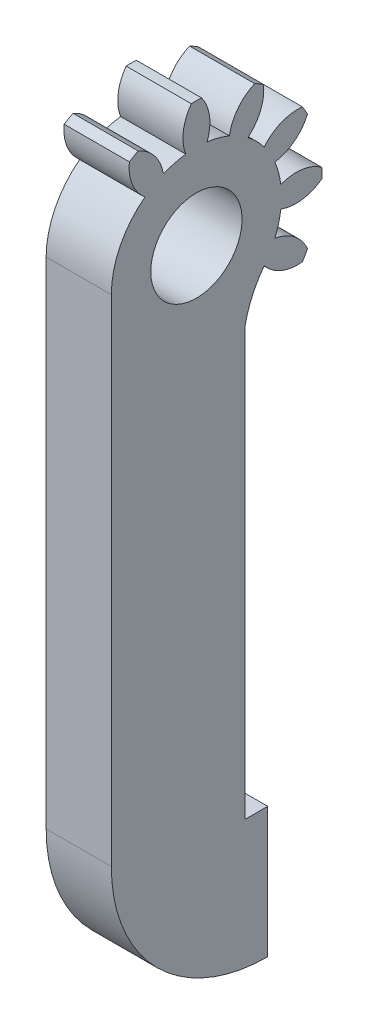
ISO-10303-21;
HEADER;
FILE_DESCRIPTION(('STEP AP214'),'2;1');
FILE_NAME('part.step','',(''),(''),'','','');
FILE_SCHEMA(('AUTOMOTIVE_DESIGN { 1 0 10303 214 1 1 1 1 }'));
ENDSEC;
DATA;
#1=APPLICATION_CONTEXT('core data for automotive mechanical design processes');
#2=APPLICATION_PROTOCOL_DEFINITION('international standard','automotive_design',2000,#1);
#3=PRODUCT_CONTEXT('',#1,'mechanical');
#4=PRODUCT('Part','Part','',(#3));
#5=PRODUCT_RELATED_PRODUCT_CATEGORY('part','',(#4));
#6=PRODUCT_DEFINITION_FORMATION('','',#4);
#7=PRODUCT_DEFINITION_CONTEXT('part definition',#1,'design');
#8=PRODUCT_DEFINITION('design','',#6,#7);
#9=PRODUCT_DEFINITION_SHAPE('','',#8);
#10=(LENGTH_UNIT() NAMED_UNIT(*) SI_UNIT(.MILLI.,.METRE.));
#11=(NAMED_UNIT(*) PLANE_ANGLE_UNIT() SI_UNIT($,.RADIAN.));
#12=(NAMED_UNIT(*) SI_UNIT($,.STERADIAN.) SOLID_ANGLE_UNIT());
#13=UNCERTAINTY_MEASURE_WITH_UNIT(LENGTH_MEASURE(1.E-05),#10,'distance_accuracy_value','');
#14=(GEOMETRIC_REPRESENTATION_CONTEXT(3) GLOBAL_UNCERTAINTY_ASSIGNED_CONTEXT((#13)) GLOBAL_UNIT_ASSIGNED_CONTEXT((#10,
#11,#12)) REPRESENTATION_CONTEXT('',''));
#15=CARTESIAN_POINT('',(0.,0.,0.));
#16=DIRECTION('',(0.,0.,1.));
#17=DIRECTION('',(1.,0.,0.));
#18=AXIS2_PLACEMENT_3D('',#15,#16,#17);
#19=CARTESIAN_POINT('',(5.,0.,0.));
#20=DIRECTION('',(-1.,0.,0.));
#21=DIRECTION('',(0.,-0.258819045102521,0.965925826289068));
#22=AXIS2_PLACEMENT_3D('',#19,#20,#21);
#23=CYLINDRICAL_SURFACE('',#22,6.53025);
#24=CARTESIAN_POINT('',(0.,0.,0.));
#25=DIRECTION('',(-1.,0.,0.));
#26=DIRECTION('',(0.,0.707106781186549,-0.707106781186546));
#27=AXIS2_PLACEMENT_3D('',#24,#25,#26);
#28=CIRCLE('',#27,6.53025);
#29=CARTESIAN_POINT('',(0.,0.,6.53025));
#30=VERTEX_POINT('',#29);
#31=CARTESIAN_POINT('',(0.,5.20307403430747,3.94616087558724));
#32=VERTEX_POINT('',#31);
#33=EDGE_CURVE('E375',#30,#32,#28,.T.);
#34=ORIENTED_EDGE('',*,*,#33,.F.);
#35=DIRECTION('',(1.,0.,0.));
#36=VECTOR('',#35,1.);
#37=CARTESIAN_POINT('',(-51.4198405287297,0.,6.53025));
#38=LINE('',#37,#36);
#39=CARTESIAN_POINT('',(5.,0.,6.53025));
#40=VERTEX_POINT('',#39);
#41=EDGE_CURVE('E682',#30,#40,#38,.T.);
#42=ORIENTED_EDGE('',*,*,#41,.T.);
#43=CARTESIAN_POINT('',(5.,0.,0.));
#44=DIRECTION('',(-1.,0.,0.));
#45=DIRECTION('',(0.,0.707106781186549,-0.707106781186546));
#46=AXIS2_PLACEMENT_3D('',#43,#44,#45);
#47=CIRCLE('',#46,6.53025);
#48=CARTESIAN_POINT('',(5.,5.20307403430747,3.94616087558724));
#49=VERTEX_POINT('',#48);
#50=EDGE_CURVE('E374',#40,#49,#47,.T.);
#51=ORIENTED_EDGE('',*,*,#50,.T.);
#52=DIRECTION('',(-1.,0.,0.));
#53=VECTOR('',#52,1.);
#54=CARTESIAN_POINT('',(5.,5.20307403430747,3.94616087558724));
#55=LINE('',#54,#53);
#56=EDGE_CURVE('E378',#49,#32,#55,.T.);
#57=ORIENTED_EDGE('',*,*,#56,.T.);
#58=EDGE_LOOP('',(#34,#42,#51,#57));
#59=FACE_BOUND('',#58,.T.);
#60=ADVANCED_FACE('F39',(#59),#23,.T.);
#61=CARTESIAN_POINT('',(5.,0.,0.));
#62=DIRECTION('',(-1.,0.,0.));
#63=DIRECTION('',(0.,-0.258819045102521,0.965925826289068));
#64=AXIS2_PLACEMENT_3D('',#61,#62,#63);
#65=PLANE('',#64);
#66=CARTESIAN_POINT('',(5.,0.,0.));
#67=DIRECTION('',(-1.,0.,0.));
#68=DIRECTION('',(0.,-0.258819045102521,0.965925826289068));
#69=AXIS2_PLACEMENT_3D('',#66,#67,#68);
#70=CIRCLE('',#69,3.5);
#71=CARTESIAN_POINT('',(5.,-0.905866657858825,3.38074039201174));
#72=VERTEX_POINT('',#71);
#73=EDGE_CURVE('E312',#72,#72,#70,.F.);
#74=ORIENTED_EDGE('',*,*,#73,.F.);
#75=EDGE_LOOP('',(#74));
#76=FACE_BOUND('',#75,.T.);
#77=ORIENTED_EDGE('',*,*,#50,.F.);
#78=DIRECTION('',(0.,-1.,0.));
#79=VECTOR('',#78,1.);
#80=CARTESIAN_POINT('',(5.,0.,6.53025));
#81=LINE('',#80,#79);
#82=CARTESIAN_POINT('',(5.,-38.,6.53025));
#83=VERTEX_POINT('',#82);
#84=EDGE_CURVE('E262',#40,#83,#81,.T.);
#85=ORIENTED_EDGE('',*,*,#84,.T.);
#86=CARTESIAN_POINT('',(5.,-38.,-5.46975));
#87=DIRECTION('',(1.,0.,0.));
#88=DIRECTION('',(0.,0.,-1.));
#89=AXIS2_PLACEMENT_3D('',#86,#87,#88);
#90=CIRCLE('',#89,12.);
#91=CARTESIAN_POINT('',(5.,-50.,-5.46975));
#92=VERTEX_POINT('',#91);
#93=EDGE_CURVE('E723',#83,#92,#90,.T.);
#94=ORIENTED_EDGE('',*,*,#93,.T.);
#95=DIRECTION('',(0.,1.,0.));
#96=VECTOR('',#95,1.);
#97=CARTESIAN_POINT('',(5.,-50.,-5.46975));
#98=LINE('',#97,#96);
#99=CARTESIAN_POINT('',(5.,-40.,-5.46975));
#100=VERTEX_POINT('',#99);
#101=EDGE_CURVE('E727',#92,#100,#98,.T.);
#102=ORIENTED_EDGE('',*,*,#101,.T.);
#103=DIRECTION('',(0.,0.,1.));
#104=VECTOR('',#103,1.);
#105=CARTESIAN_POINT('',(5.,-40.,-5.46975));
#106=LINE('',#105,#104);
#107=CARTESIAN_POINT('',(5.,-40.,-3.71975));
#108=VERTEX_POINT('',#107);
#109=EDGE_CURVE('E730',#100,#108,#106,.T.);
#110=ORIENTED_EDGE('',*,*,#109,.T.);
#111=DIRECTION('',(0.,1.,0.));
#112=VECTOR('',#111,1.);
#113=CARTESIAN_POINT('',(5.,-40.,-3.71975));
#114=LINE('',#113,#112);
#115=CARTESIAN_POINT('',(5.,-7.27695193070973,-3.71975));
#116=VERTEX_POINT('',#115);
#117=EDGE_CURVE('E260',#108,#116,#114,.T.);
#118=ORIENTED_EDGE('',*,*,#117,.T.);
#119=CARTESIAN_POINT('',(5.,-8.78047610160418,-11.5771932907617));
#120=DIRECTION('',(-1.,0.,0.));
#121=DIRECTION('',(0.,0.,-1.));
#122=AXIS2_PLACEMENT_3D('',#119,#120,#121);
#123=CIRCLE('',#122,8.);
#124=CARTESIAN_POINT('',(5.,-3.94616087558718,-5.20307403430751));
#125=VERTEX_POINT('',#124);
#126=EDGE_CURVE('E243',#116,#125,#123,.T.);
#127=ORIENTED_EDGE('',*,*,#126,.T.);
#128=CARTESIAN_POINT('',(5.,-1.86722961459183,-7.76589373379014));
#129=DIRECTION('',(-1.,0.,0.));
#130=DIRECTION('',(0.,-0.707106781186554,0.707106781186541));
#131=AXIS2_PLACEMENT_3D('',#128,#129,#130);
#132=CIRCLE('',#131,3.3);
#133=CARTESIAN_POINT('',(5.,-5.14670283362097,-8.13339258504088));
#134=VERTEX_POINT('',#133);
#135=EDGE_CURVE('E251',#134,#125,#132,.T.);
#136=ORIENTED_EDGE('',*,*,#135,.F.);
#137=CARTESIAN_POINT('',(5.,0.,0.));
#138=DIRECTION('',(-1.,0.,0.));
#139=DIRECTION('',(0.,-0.258819045102521,0.965925826289068));
#140=AXIS2_PLACEMENT_3D('',#137,#138,#139);
#141=CIRCLE('',#140,9.625);
#142=CARTESIAN_POINT('',(5.,-4.47037318078674,-8.52387169216564));
#143=VERTEX_POINT('',#142);
#144=EDGE_CURVE('E435',#143,#134,#141,.T.);
#145=ORIENTED_EDGE('',*,*,#144,.F.);
#146=CARTESIAN_POINT('',(5.,-5.79184644925663,-5.50001514783033));
#147=DIRECTION('',(-1.,0.,0.));
#148=DIRECTION('',(0.,-0.965925826289071,0.258819045102511));
#149=AXIS2_PLACEMENT_3D('',#146,#147,#148);
#150=CIRCLE('',#149,3.3);
#151=CARTESIAN_POINT('',(5.,-2.53291385368778,-6.01901258283255));
#152=VERTEX_POINT('',#151);
#153=EDGE_CURVE('E689',#152,#143,#150,.T.);
#154=ORIENTED_EDGE('',*,*,#153,.F.);
#155=CARTESIAN_POINT('',(5.,0.,0.));
#156=DIRECTION('',(-1.,0.,0.));
#157=DIRECTION('',(0.,-0.965925826289071,0.258819045102511));
#158=AXIS2_PLACEMENT_3D('',#155,#156,#157);
#159=CIRCLE('',#158,6.53025);
#160=CARTESIAN_POINT('',(5.,-0.815938548524985,-6.47907472927508));
#161=VERTEX_POINT('',#160);
#162=EDGE_CURVE('E695',#161,#152,#159,.T.);
#163=ORIENTED_EDGE('',*,*,#162,.F.);
#164=CARTESIAN_POINT('',(5.,2.26587858595993,-7.65907606384856));
#165=DIRECTION('',(-1.,0.,0.));
#166=DIRECTION('',(0.,-0.965925826289071,0.258819045102511));
#167=AXIS2_PLACEMENT_3D('',#164,#165,#166);
#168=CIRCLE('',#167,3.3);
#169=CARTESIAN_POINT('',(5.,-0.390479107124668,-9.61707601440787));
#170=VERTEX_POINT('',#169);
#171=EDGE_CURVE('E501',#170,#161,#168,.T.);
#172=ORIENTED_EDGE('',*,*,#171,.F.);
#173=CARTESIAN_POINT('',(5.,0.39047910712487,-9.61707601440786));
#174=VERTEX_POINT('',#173);
#175=EDGE_CURVE('E498',#174,#170,#141,.T.);
#176=ORIENTED_EDGE('',*,*,#175,.F.);
#177=CARTESIAN_POINT('',(5.,-2.26587858595977,-7.65907606384861));
#178=DIRECTION('',(-1.,0.,0.));
#179=DIRECTION('',(0.,-0.965925826289065,-0.258819045102531));
#180=AXIS2_PLACEMENT_3D('',#177,#178,#179);
#181=CIRCLE('',#180,3.3);
#182=CARTESIAN_POINT('',(5.,0.815938548525121,-6.47907472927507));
#183=VERTEX_POINT('',#182);
#184=EDGE_CURVE('E275',#183,#174,#181,.T.);
#185=ORIENTED_EDGE('',*,*,#184,.F.);
#186=CARTESIAN_POINT('',(5.,0.,0.));
#187=DIRECTION('',(-1.,0.,0.));
#188=DIRECTION('',(0.,-0.965925826289065,-0.258819045102531));
#189=AXIS2_PLACEMENT_3D('',#186,#187,#188);
#190=CIRCLE('',#189,6.53025);
#191=CARTESIAN_POINT('',(5.,2.53291385368791,-6.0190125828325));
#192=VERTEX_POINT('',#191);
#193=EDGE_CURVE('E282',#192,#183,#190,.T.);
#194=ORIENTED_EDGE('',*,*,#193,.F.);
#195=CARTESIAN_POINT('',(5.,5.79184644925675,-5.5000151478302));
#196=DIRECTION('',(-1.,0.,0.));
#197=DIRECTION('',(0.,-0.965925826289065,-0.258819045102531));
#198=AXIS2_PLACEMENT_3D('',#195,#196,#197);
#199=CIRCLE('',#198,3.3);
#200=CARTESIAN_POINT('',(5.,4.47037318078692,-8.52387169216555));
#201=VERTEX_POINT('',#200);
#202=EDGE_CURVE('E278',#201,#192,#199,.T.);
#203=ORIENTED_EDGE('',*,*,#202,.F.);
#204=CARTESIAN_POINT('',(5.,5.14670283362114,-8.13339258504077));
#205=VERTEX_POINT('',#204);
#206=EDGE_CURVE('E479',#205,#201,#141,.T.);
#207=ORIENTED_EDGE('',*,*,#206,.F.);
#208=CARTESIAN_POINT('',(5.,1.86722961459199,-7.7658937337901));
#209=DIRECTION('',(-1.,0.,0.));
#210=DIRECTION('',(0.,-0.707106781186539,-0.707106781186556));
#211=AXIS2_PLACEMENT_3D('',#208,#209,#210);
#212=CIRCLE('',#211,3.3);
#213=CARTESIAN_POINT('',(5.,3.9461608755873,-5.20307403430743));
#214=VERTEX_POINT('',#213);
#215=EDGE_CURVE('E323',#214,#205,#212,.T.);
#216=ORIENTED_EDGE('',*,*,#215,.F.);
#217=CARTESIAN_POINT('',(5.,0.,0.));
#218=DIRECTION('',(-1.,0.,0.));
#219=DIRECTION('',(0.,-0.707106781186539,-0.707106781186556));
#220=AXIS2_PLACEMENT_3D('',#217,#218,#219);
#221=CIRCLE('',#220,6.53025);
#222=CARTESIAN_POINT('',(5.,5.20307403430752,-3.94616087558717));
#223=VERTEX_POINT('',#222);
#224=EDGE_CURVE('E330',#223,#214,#221,.T.);
#225=ORIENTED_EDGE('',*,*,#224,.F.);
#226=CARTESIAN_POINT('',(5.,7.76589373379015,-1.8672296145918));
#227=DIRECTION('',(-1.,0.,0.));
#228=DIRECTION('',(0.,-0.707106781186539,-0.707106781186556));
#229=AXIS2_PLACEMENT_3D('',#226,#227,#228);
#230=CIRCLE('',#229,3.3);
#231=CARTESIAN_POINT('',(5.,8.13339258504089,-5.14670283362094));
#232=VERTEX_POINT('',#231);
#233=EDGE_CURVE('E326',#232,#223,#230,.T.);
#234=ORIENTED_EDGE('',*,*,#233,.F.);
#235=CARTESIAN_POINT('',(5.,8.52387169216565,-4.47037318078671));
#236=VERTEX_POINT('',#235);
#237=EDGE_CURVE('E434',#236,#232,#141,.T.);
#238=ORIENTED_EDGE('',*,*,#237,.F.);
#239=CARTESIAN_POINT('',(5.,5.50001514783035,-5.79184644925661));
#240=DIRECTION('',(-1.,0.,0.));
#241=DIRECTION('',(0.,-0.258819045102508,-0.965925826289072));
#242=AXIS2_PLACEMENT_3D('',#239,#240,#241);
#243=CIRCLE('',#242,3.3);
#244=CARTESIAN_POINT('',(5.,6.01901258283256,-2.53291385368776));
#245=VERTEX_POINT('',#244);
#246=EDGE_CURVE('E297',#245,#236,#243,.T.);
#247=ORIENTED_EDGE('',*,*,#246,.F.);
#248=CARTESIAN_POINT('',(5.,0.,0.));
#249=DIRECTION('',(-1.,0.,0.));
#250=DIRECTION('',(0.,-0.258819045102508,-0.965925826289072));
#251=AXIS2_PLACEMENT_3D('',#248,#249,#250);
#252=CIRCLE('',#251,6.53025);
#253=CARTESIAN_POINT('',(5.,6.47907472927509,-0.815938548524962));
#254=VERTEX_POINT('',#253);
#255=EDGE_CURVE('E304',#254,#245,#252,.T.);
#256=ORIENTED_EDGE('',*,*,#255,.F.);
#257=CARTESIAN_POINT('',(5.,7.65907606384855,2.26587858595996));
#258=DIRECTION('',(-1.,0.,0.));
#259=DIRECTION('',(0.,-0.258819045102508,-0.965925826289072));
#260=AXIS2_PLACEMENT_3D('',#257,#258,#259);
#261=CIRCLE('',#260,3.3);
#262=CARTESIAN_POINT('',(5.,9.61707601440787,-0.390479107124634));
#263=VERTEX_POINT('',#262);
#264=EDGE_CURVE('E300',#263,#254,#261,.T.);
#265=ORIENTED_EDGE('',*,*,#264,.F.);
#266=CARTESIAN_POINT('',(5.,9.61707601440787,0.39047910712477));
#267=VERTEX_POINT('',#266);
#268=EDGE_CURVE('E429',#267,#263,#141,.T.);
#269=ORIENTED_EDGE('',*,*,#268,.F.);
#270=CARTESIAN_POINT('',(5.,7.65907606384858,-2.26587858595985));
#271=DIRECTION('',(-1.,0.,0.));
#272=DIRECTION('',(0.,0.258819045102521,-0.965925826289068));
#273=AXIS2_PLACEMENT_3D('',#270,#271,#272);
#274=CIRCLE('',#273,3.3);
#275=CARTESIAN_POINT('',(5.,6.47907472927507,0.815938548525054));
#276=VERTEX_POINT('',#275);
#277=EDGE_CURVE('E391',#276,#267,#274,.T.);
#278=ORIENTED_EDGE('',*,*,#277,.F.);
#279=CARTESIAN_POINT('',(5.,0.,0.));
#280=DIRECTION('',(-1.,0.,0.));
#281=DIRECTION('',(0.,0.258819045102521,-0.965925826289068));
#282=AXIS2_PLACEMENT_3D('',#279,#280,#281);
#283=CIRCLE('',#282,6.53025);
#284=CARTESIAN_POINT('',(5.,6.01901258283252,2.53291385368785));
#285=VERTEX_POINT('',#284);
#286=EDGE_CURVE('E398',#285,#276,#283,.T.);
#287=ORIENTED_EDGE('',*,*,#286,.F.);
#288=CARTESIAN_POINT('',(5.,5.50001514783026,5.79184644925669));
#289=DIRECTION('',(-1.,0.,0.));
#290=DIRECTION('',(0.,0.258819045102521,-0.965925826289068));
#291=AXIS2_PLACEMENT_3D('',#288,#289,#290);
#292=CIRCLE('',#291,3.3);
#293=CARTESIAN_POINT('',(5.,8.52387169216559,4.47037318078683));
#294=VERTEX_POINT('',#293);
#295=EDGE_CURVE('E394',#294,#285,#292,.T.);
#296=ORIENTED_EDGE('',*,*,#295,.F.);
#297=CARTESIAN_POINT('',(5.,8.13339258504082,5.14670283362106));
#298=VERTEX_POINT('',#297);
#299=EDGE_CURVE('E426',#298,#294,#141,.T.);
#300=ORIENTED_EDGE('',*,*,#299,.F.);
#301=CARTESIAN_POINT('',(5.,7.76589373379012,1.86722961459191));
#302=DIRECTION('',(-1.,0.,0.));
#303=DIRECTION('',(0.,0.707106781186549,-0.707106781186546));
#304=AXIS2_PLACEMENT_3D('',#301,#302,#303);
#305=CIRCLE('',#304,3.3);
#306=EDGE_CURVE('E371',#49,#298,#305,.T.);
#307=ORIENTED_EDGE('',*,*,#306,.F.);
#308=EDGE_LOOP('',(#77,#85,#94,#102,#110,#118,#127,#136,#145,#154,#163,#172,#176,#185,#194,#203,
#207,#216,#225,#234,#238,#247,#256,#265,#269,#278,#287,#296,#300,#307));
#309=FACE_BOUND('',#308,.T.);
#310=ADVANCED_FACE('F41',(#76,#309),#65,.F.);
#311=CARTESIAN_POINT('',(-10.,0.,0.));
#312=DIRECTION('',(-1.,0.,0.));
#313=DIRECTION('',(0.,-0.258819045102521,0.965925826289068));
#314=AXIS2_PLACEMENT_3D('',#311,#312,#313);
#315=CYLINDRICAL_SURFACE('',#314,9.625);
#316=DIRECTION('',(-1.,0.,0.));
#317=VECTOR('',#316,1.);
#318=CARTESIAN_POINT('',(2.5,-4.47037318078674,-8.52387169216564));
#319=LINE('',#318,#317);
#320=CARTESIAN_POINT('',(0.,-4.47037318078674,-8.52387169216564));
#321=VERTEX_POINT('',#320);
#322=EDGE_CURVE('E367',#143,#321,#319,.T.);
#323=ORIENTED_EDGE('',*,*,#322,.F.);
#324=ORIENTED_EDGE('',*,*,#144,.T.);
#325=DIRECTION('',(-1.,0.,0.));
#326=VECTOR('',#325,1.);
#327=CARTESIAN_POINT('',(2.5,-5.14670283362097,-8.13339258504088));
#328=LINE('',#327,#326);
#329=CARTESIAN_POINT('',(0.,-5.14670283362097,-8.13339258504088));
#330=VERTEX_POINT('',#329);
#331=EDGE_CURVE('E266',#330,#134,#328,.F.);
#332=ORIENTED_EDGE('',*,*,#331,.F.);
#333=CARTESIAN_POINT('',(0.,0.,0.));
#334=DIRECTION('',(-1.,0.,0.));
#335=DIRECTION('',(0.,-0.258819045102521,0.965925826289068));
#336=AXIS2_PLACEMENT_3D('',#333,#334,#335);
#337=CIRCLE('',#336,9.625);
#338=EDGE_CURVE('E428',#321,#330,#337,.T.);
#339=ORIENTED_EDGE('',*,*,#338,.F.);
#340=EDGE_LOOP('',(#323,#324,#332,#339));
#341=FACE_BOUND('',#340,.T.);
#342=ADVANCED_FACE('F454',(#341),#315,.T.);
#343=DIRECTION('',(-1.,0.,0.));
#344=VECTOR('',#343,1.);
#345=CARTESIAN_POINT('',(2.5,-0.39047910712467,-9.61707601440787));
#346=LINE('',#345,#344);
#347=CARTESIAN_POINT('',(0.,-0.390479107124669,-9.61707601440787));
#348=VERTEX_POINT('',#347);
#349=EDGE_CURVE('E364',#348,#170,#346,.F.);
#350=ORIENTED_EDGE('',*,*,#349,.F.);
#351=CARTESIAN_POINT('',(0.,0.390479107124871,-9.61707601440786));
#352=VERTEX_POINT('',#351);
#353=EDGE_CURVE('E458',#352,#348,#337,.T.);
#354=ORIENTED_EDGE('',*,*,#353,.F.);
#355=DIRECTION('',(-1.,0.,0.));
#356=VECTOR('',#355,1.);
#357=CARTESIAN_POINT('',(2.5,0.390479107124871,-9.61707601440786));
#358=LINE('',#357,#356);
#359=EDGE_CURVE('E359',#174,#352,#358,.T.);
#360=ORIENTED_EDGE('',*,*,#359,.F.);
#361=ORIENTED_EDGE('',*,*,#175,.T.);
#362=EDGE_LOOP('',(#350,#354,#360,#361));
#363=FACE_BOUND('',#362,.T.);
#364=ADVANCED_FACE('F497',(#363),#315,.T.);
#365=DIRECTION('',(-1.,0.,0.));
#366=VECTOR('',#365,1.);
#367=CARTESIAN_POINT('',(2.5,4.47037318078692,-8.52387169216555));
#368=LINE('',#367,#366);
#369=CARTESIAN_POINT('',(0.,4.47037318078692,-8.52387169216555));
#370=VERTEX_POINT('',#369);
#371=EDGE_CURVE('E356',#370,#201,#368,.F.);
#372=ORIENTED_EDGE('',*,*,#371,.F.);
#373=CARTESIAN_POINT('',(0.,5.14670283362114,-8.13339258504076));
#374=VERTEX_POINT('',#373);
#375=EDGE_CURVE('E462',#374,#370,#337,.T.);
#376=ORIENTED_EDGE('',*,*,#375,.F.);
#377=DIRECTION('',(-1.,0.,0.));
#378=VECTOR('',#377,1.);
#379=CARTESIAN_POINT('',(2.5,5.14670283362114,-8.13339258504076));
#380=LINE('',#379,#378);
#381=EDGE_CURVE('E347',#205,#374,#380,.T.);
#382=ORIENTED_EDGE('',*,*,#381,.F.);
#383=ORIENTED_EDGE('',*,*,#206,.T.);
#384=EDGE_LOOP('',(#372,#376,#382,#383));
#385=FACE_BOUND('',#384,.T.);
#386=ADVANCED_FACE('F476',(#385),#315,.T.);
#387=DIRECTION('',(-1.,0.,0.));
#388=VECTOR('',#387,1.);
#389=CARTESIAN_POINT('',(2.5,8.52387169216565,-4.47037318078671));
#390=LINE('',#389,#388);
#391=CARTESIAN_POINT('',(0.,8.52387169216565,-4.47037318078671));
#392=VERTEX_POINT('',#391);
#393=EDGE_CURVE('E353',#236,#392,#390,.T.);
#394=ORIENTED_EDGE('',*,*,#393,.F.);
#395=ORIENTED_EDGE('',*,*,#237,.T.);
#396=DIRECTION('',(-1.,0.,0.));
#397=VECTOR('',#396,1.);
#398=CARTESIAN_POINT('',(2.5,8.13339258504089,-5.14670283362094));
#399=LINE('',#398,#397);
#400=CARTESIAN_POINT('',(0.,8.13339258504089,-5.14670283362094));
#401=VERTEX_POINT('',#400);
#402=EDGE_CURVE('E250',#401,#232,#399,.F.);
#403=ORIENTED_EDGE('',*,*,#402,.F.);
#404=EDGE_CURVE('E427',#392,#401,#337,.T.);
#405=ORIENTED_EDGE('',*,*,#404,.F.);
#406=EDGE_LOOP('',(#394,#395,#403,#405));
#407=FACE_BOUND('',#406,.T.);
#408=ADVANCED_FACE('F516',(#407),#315,.T.);
#409=DIRECTION('',(-1.,0.,0.));
#410=VECTOR('',#409,1.);
#411=CARTESIAN_POINT('',(2.5,9.61707601440787,-0.390479107124634));
#412=LINE('',#411,#410);
#413=CARTESIAN_POINT('',(0.,9.61707601440787,-0.390479107124634));
#414=VERTEX_POINT('',#413);
#415=EDGE_CURVE('E350',#414,#263,#412,.F.);
#416=ORIENTED_EDGE('',*,*,#415,.F.);
#417=CARTESIAN_POINT('',(0.,9.61707601440786,0.39047910712477));
#418=VERTEX_POINT('',#417);
#419=EDGE_CURVE('E422',#418,#414,#337,.T.);
#420=ORIENTED_EDGE('',*,*,#419,.F.);
#421=DIRECTION('',(-1.,0.,0.));
#422=VECTOR('',#421,1.);
#423=CARTESIAN_POINT('',(2.5,9.61707601440786,0.39047910712477));
#424=LINE('',#423,#422);
#425=EDGE_CURVE('E418',#267,#418,#424,.T.);
#426=ORIENTED_EDGE('',*,*,#425,.F.);
#427=ORIENTED_EDGE('',*,*,#268,.T.);
#428=EDGE_LOOP('',(#416,#420,#426,#427));
#429=FACE_BOUND('',#428,.T.);
#430=ADVANCED_FACE('F564',(#429),#315,.T.);
#431=CARTESIAN_POINT('',(0.,0.,0.));
#432=DIRECTION('',(1.,0.,0.));
#433=DIRECTION('',(0.,0.258819045102521,-0.965925826289068));
#434=AXIS2_PLACEMENT_3D('',#431,#432,#433);
#435=PLANE('',#434);
#436=CARTESIAN_POINT('',(0.,0.,0.));
#437=DIRECTION('',(1.,0.,0.));
#438=DIRECTION('',(0.,0.258819045102521,-0.965925826289068));
#439=AXIS2_PLACEMENT_3D('',#436,#437,#438);
#440=CIRCLE('',#439,3.5);
#441=CARTESIAN_POINT('',(0.,0.905866657858825,-3.38074039201174));
#442=VERTEX_POINT('',#441);
#443=EDGE_CURVE('E43',#442,#442,#440,.F.);
#444=ORIENTED_EDGE('',*,*,#443,.F.);
#445=EDGE_LOOP('',(#444));
#446=FACE_BOUND('',#445,.T.);
#447=CARTESIAN_POINT('',(0.,-1.86722961459183,-7.76589373379014));
#448=DIRECTION('',(1.,0.,0.));
#449=DIRECTION('',(0.,0.258819045102521,-0.965925826289068));
#450=AXIS2_PLACEMENT_3D('',#447,#448,#449);
#451=CIRCLE('',#450,3.3);
#452=CARTESIAN_POINT('',(0.,-3.94616087558719,-5.20307403430751));
#453=VERTEX_POINT('',#452);
#454=EDGE_CURVE('E49',#453,#330,#451,.T.);
#455=ORIENTED_EDGE('',*,*,#454,.F.);
#456=CARTESIAN_POINT('',(0.,-8.78047610160418,-11.5771932907617));
#457=DIRECTION('',(1.,0.,0.));
#458=DIRECTION('',(0.,0.,-1.));
#459=AXIS2_PLACEMENT_3D('',#456,#457,#458);
#460=CIRCLE('',#459,8.);
#461=CARTESIAN_POINT('',(0.,-7.27695193070973,-3.71975));
#462=VERTEX_POINT('',#461);
#463=EDGE_CURVE('E245',#453,#462,#460,.T.);
#464=ORIENTED_EDGE('',*,*,#463,.T.);
#465=DIRECTION('',(0.,-1.,0.));
#466=VECTOR('',#465,1.);
#467=CARTESIAN_POINT('',(0.,-40.,-3.71975));
#468=LINE('',#467,#466);
#469=CARTESIAN_POINT('',(0.,-40.,-3.71975));
#470=VERTEX_POINT('',#469);
#471=EDGE_CURVE('E655',#462,#470,#468,.T.);
#472=ORIENTED_EDGE('',*,*,#471,.T.);
#473=DIRECTION('',(0.,0.,-1.));
#474=VECTOR('',#473,1.);
#475=CARTESIAN_POINT('',(0.,-40.,-5.46975));
#476=LINE('',#475,#474);
#477=CARTESIAN_POINT('',(0.,-40.,-5.46975));
#478=VERTEX_POINT('',#477);
#479=EDGE_CURVE('E660',#470,#478,#476,.T.);
#480=ORIENTED_EDGE('',*,*,#479,.T.);
#481=DIRECTION('',(0.,-1.,0.));
#482=VECTOR('',#481,1.);
#483=CARTESIAN_POINT('',(0.,-50.,-5.46975));
#484=LINE('',#483,#482);
#485=CARTESIAN_POINT('',(0.,-50.,-5.46975));
#486=VERTEX_POINT('',#485);
#487=EDGE_CURVE('E712',#478,#486,#484,.T.);
#488=ORIENTED_EDGE('',*,*,#487,.T.);
#489=CARTESIAN_POINT('',(0.,-38.,-5.46975));
#490=DIRECTION('',(1.,0.,0.));
#491=DIRECTION('',(0.,0.,-1.));
#492=AXIS2_PLACEMENT_3D('',#489,#490,#491);
#493=CIRCLE('',#492,12.);
#494=CARTESIAN_POINT('',(0.,-38.,6.53025));
#495=VERTEX_POINT('',#494);
#496=EDGE_CURVE('E667',#486,#495,#493,.F.);
#497=ORIENTED_EDGE('',*,*,#496,.T.);
#498=DIRECTION('',(0.,1.,0.));
#499=VECTOR('',#498,1.);
#500=CARTESIAN_POINT('',(0.,0.,6.53025));
#501=LINE('',#500,#499);
#502=EDGE_CURVE('E663',#495,#30,#501,.T.);
#503=ORIENTED_EDGE('',*,*,#502,.T.);
#504=ORIENTED_EDGE('',*,*,#33,.T.);
#505=CARTESIAN_POINT('',(0.,7.76589373379012,1.86722961459191));
#506=DIRECTION('',(-1.,0.,0.));
#507=DIRECTION('',(0.,0.707106781186549,-0.707106781186546));
#508=AXIS2_PLACEMENT_3D('',#505,#506,#507);
#509=CIRCLE('',#508,3.3);
#510=CARTESIAN_POINT('',(0.,8.13339258504082,5.14670283362106));
#511=VERTEX_POINT('',#510);
#512=EDGE_CURVE('E370',#32,#511,#509,.T.);
#513=ORIENTED_EDGE('',*,*,#512,.T.);
#514=CARTESIAN_POINT('',(0.,8.52387169216559,4.47037318078683));
#515=VERTEX_POINT('',#514);
#516=EDGE_CURVE('E421',#511,#515,#337,.T.);
#517=ORIENTED_EDGE('',*,*,#516,.T.);
#518=CARTESIAN_POINT('',(0.,5.50001514783026,5.79184644925669));
#519=DIRECTION('',(1.,0.,0.));
#520=DIRECTION('',(0.,0.258819045102521,-0.965925826289068));
#521=AXIS2_PLACEMENT_3D('',#518,#519,#520);
#522=CIRCLE('',#521,3.3);
#523=CARTESIAN_POINT('',(0.,6.01901258283252,2.53291385368785));
#524=VERTEX_POINT('',#523);
#525=EDGE_CURVE('E433',#524,#515,#522,.T.);
#526=ORIENTED_EDGE('',*,*,#525,.F.);
#527=CARTESIAN_POINT('',(0.,0.,0.));
#528=DIRECTION('',(-1.,0.,0.));
#529=DIRECTION('',(0.,0.258819045102521,-0.965925826289068));
#530=AXIS2_PLACEMENT_3D('',#527,#528,#529);
#531=CIRCLE('',#530,6.53025);
#532=CARTESIAN_POINT('',(0.,6.47907472927507,0.815938548525054));
#533=VERTEX_POINT('',#532);
#534=EDGE_CURVE('E395',#524,#533,#531,.T.);
#535=ORIENTED_EDGE('',*,*,#534,.T.);
#536=CARTESIAN_POINT('',(0.,7.65907606384858,-2.26587858595985));
#537=DIRECTION('',(-1.,0.,0.));
#538=DIRECTION('',(0.,0.258819045102521,-0.965925826289068));
#539=AXIS2_PLACEMENT_3D('',#536,#537,#538);
#540=CIRCLE('',#539,3.3);
#541=EDGE_CURVE('E390',#533,#418,#540,.T.);
#542=ORIENTED_EDGE('',*,*,#541,.T.);
#543=ORIENTED_EDGE('',*,*,#419,.T.);
#544=CARTESIAN_POINT('',(0.,7.65907606384855,2.26587858595996));
#545=DIRECTION('',(1.,0.,0.));
#546=DIRECTION('',(0.,0.258819045102521,-0.965925826289068));
#547=AXIS2_PLACEMENT_3D('',#544,#545,#546);
#548=CIRCLE('',#547,3.3);
#549=CARTESIAN_POINT('',(0.,6.47907472927509,-0.815938548524962));
#550=VERTEX_POINT('',#549);
#551=EDGE_CURVE('E442',#550,#414,#548,.T.);
#552=ORIENTED_EDGE('',*,*,#551,.F.);
#553=CARTESIAN_POINT('',(0.,0.,0.));
#554=DIRECTION('',(-1.,0.,0.));
#555=DIRECTION('',(0.,-0.258819045102508,-0.965925826289072));
#556=AXIS2_PLACEMENT_3D('',#553,#554,#555);
#557=CIRCLE('',#556,6.53025);
#558=CARTESIAN_POINT('',(0.,6.01901258283256,-2.53291385368776));
#559=VERTEX_POINT('',#558);
#560=EDGE_CURVE('E301',#550,#559,#557,.T.);
#561=ORIENTED_EDGE('',*,*,#560,.T.);
#562=CARTESIAN_POINT('',(0.,5.50001514783035,-5.79184644925661));
#563=DIRECTION('',(-1.,0.,0.));
#564=DIRECTION('',(0.,-0.258819045102508,-0.965925826289072));
#565=AXIS2_PLACEMENT_3D('',#562,#563,#564);
#566=CIRCLE('',#565,3.3);
#567=EDGE_CURVE('E308',#559,#392,#566,.T.);
#568=ORIENTED_EDGE('',*,*,#567,.T.);
#569=ORIENTED_EDGE('',*,*,#404,.T.);
#570=CARTESIAN_POINT('',(0.,7.76589373379015,-1.8672296145918));
#571=DIRECTION('',(1.,0.,0.));
#572=DIRECTION('',(0.,0.258819045102521,-0.965925826289068));
#573=AXIS2_PLACEMENT_3D('',#570,#571,#572);
#574=CIRCLE('',#573,3.3);
#575=CARTESIAN_POINT('',(0.,5.20307403430752,-3.94616087558717));
#576=VERTEX_POINT('',#575);
#577=EDGE_CURVE('E439',#576,#401,#574,.T.);
#578=ORIENTED_EDGE('',*,*,#577,.F.);
#579=CARTESIAN_POINT('',(0.,0.,0.));
#580=DIRECTION('',(-1.,0.,0.));
#581=DIRECTION('',(0.,-0.707106781186539,-0.707106781186556));
#582=AXIS2_PLACEMENT_3D('',#579,#580,#581);
#583=CIRCLE('',#582,6.53025);
#584=CARTESIAN_POINT('',(0.,3.9461608755873,-5.20307403430743));
#585=VERTEX_POINT('',#584);
#586=EDGE_CURVE('E327',#576,#585,#583,.T.);
#587=ORIENTED_EDGE('',*,*,#586,.T.);
#588=CARTESIAN_POINT('',(0.,1.86722961459199,-7.7658937337901));
#589=DIRECTION('',(-1.,0.,0.));
#590=DIRECTION('',(0.,-0.707106781186539,-0.707106781186556));
#591=AXIS2_PLACEMENT_3D('',#588,#589,#590);
#592=CIRCLE('',#591,3.3);
#593=EDGE_CURVE('E322',#585,#374,#592,.T.);
#594=ORIENTED_EDGE('',*,*,#593,.T.);
#595=ORIENTED_EDGE('',*,*,#375,.T.);
#596=CARTESIAN_POINT('',(0.,5.79184644925675,-5.5000151478302));
#597=DIRECTION('',(1.,0.,0.));
#598=DIRECTION('',(0.,0.258819045102521,-0.965925826289068));
#599=AXIS2_PLACEMENT_3D('',#596,#597,#598);
#600=CIRCLE('',#599,3.3);
#601=CARTESIAN_POINT('',(0.,2.53291385368791,-6.0190125828325));
#602=VERTEX_POINT('',#601);
#603=EDGE_CURVE('E445',#602,#370,#600,.T.);
#604=ORIENTED_EDGE('',*,*,#603,.F.);
#605=CARTESIAN_POINT('',(0.,0.,0.));
#606=DIRECTION('',(-1.,0.,0.));
#607=DIRECTION('',(0.,-0.965925826289065,-0.258819045102531));
#608=AXIS2_PLACEMENT_3D('',#605,#606,#607);
#609=CIRCLE('',#608,6.53025);
#610=CARTESIAN_POINT('',(0.,0.815938548525121,-6.47907472927507));
#611=VERTEX_POINT('',#610);
#612=EDGE_CURVE('E279',#602,#611,#609,.T.);
#613=ORIENTED_EDGE('',*,*,#612,.T.);
#614=CARTESIAN_POINT('',(0.,-2.26587858595977,-7.65907606384861));
#615=DIRECTION('',(-1.,0.,0.));
#616=DIRECTION('',(0.,-0.965925826289065,-0.258819045102531));
#617=AXIS2_PLACEMENT_3D('',#614,#615,#616);
#618=CIRCLE('',#617,3.3);
#619=EDGE_CURVE('E64',#611,#352,#618,.T.);
#620=ORIENTED_EDGE('',*,*,#619,.T.);
#621=ORIENTED_EDGE('',*,*,#353,.T.);
#622=CARTESIAN_POINT('',(0.,2.26587858595993,-7.65907606384856));
#623=DIRECTION('',(1.,0.,0.));
#624=DIRECTION('',(0.,0.258819045102521,-0.965925826289068));
#625=AXIS2_PLACEMENT_3D('',#622,#623,#624);
#626=CIRCLE('',#625,3.3);
#627=CARTESIAN_POINT('',(0.,-0.815938548524985,-6.47907472927508));
#628=VERTEX_POINT('',#627);
#629=EDGE_CURVE('E11',#628,#348,#626,.T.);
#630=ORIENTED_EDGE('',*,*,#629,.F.);
#631=CARTESIAN_POINT('',(0.,0.,0.));
#632=DIRECTION('',(-1.,0.,0.));
#633=DIRECTION('',(0.,-0.965925826289071,0.258819045102511));
#634=AXIS2_PLACEMENT_3D('',#631,#632,#633);
#635=CIRCLE('',#634,6.53025);
#636=CARTESIAN_POINT('',(0.,-2.53291385368778,-6.01901258283255));
#637=VERTEX_POINT('',#636);
#638=EDGE_CURVE('E692',#628,#637,#635,.T.);
#639=ORIENTED_EDGE('',*,*,#638,.T.);
#640=CARTESIAN_POINT('',(0.,-5.79184644925663,-5.50001514783033));
#641=DIRECTION('',(-1.,0.,0.));
#642=DIRECTION('',(0.,-0.965925826289071,0.258819045102511));
#643=AXIS2_PLACEMENT_3D('',#640,#641,#642);
#644=CIRCLE('',#643,3.3);
#645=EDGE_CURVE('E56',#637,#321,#644,.T.);
#646=ORIENTED_EDGE('',*,*,#645,.T.);
#647=ORIENTED_EDGE('',*,*,#338,.T.);
#648=EDGE_LOOP('',(#455,#464,#472,#480,#488,#497,#503,#504,#513,#517,#526,#535,#542,#543,#552,
#561,#568,#569,#578,#587,#594,#595,#604,#613,#620,#621,#630,#639,#646,#647));
#649=FACE_BOUND('',#648,.T.);
#650=ADVANCED_FACE('F455',(#446,#649),#435,.F.);
#651=DIRECTION('',(-1.,0.,0.));
#652=VECTOR('',#651,1.);
#653=CARTESIAN_POINT('',(2.5,8.13339258504082,5.14670283362106));
#654=LINE('',#653,#652);
#655=EDGE_CURVE('E387',#298,#511,#654,.T.);
#656=ORIENTED_EDGE('',*,*,#655,.F.);
#657=ORIENTED_EDGE('',*,*,#299,.T.);
#658=DIRECTION('',(-1.,0.,0.));
#659=VECTOR('',#658,1.);
#660=CARTESIAN_POINT('',(2.5,8.52387169216559,4.47037318078683));
#661=LINE('',#660,#659);
#662=EDGE_CURVE('E414',#515,#294,#661,.F.);
#663=ORIENTED_EDGE('',*,*,#662,.F.);
#664=ORIENTED_EDGE('',*,*,#516,.F.);
#665=EDGE_LOOP('',(#656,#657,#663,#664));
#666=FACE_BOUND('',#665,.T.);
#667=ADVANCED_FACE('F561',(#666),#315,.T.);
#668=CARTESIAN_POINT('',(5.,7.65907606384858,-2.26587858595985));
#669=DIRECTION('',(-1.,0.,0.));
#670=DIRECTION('',(0.,-0.258819045102521,0.965925826289068));
#671=AXIS2_PLACEMENT_3D('',#668,#669,#670);
#672=CYLINDRICAL_SURFACE('',#671,3.3);
#673=ORIENTED_EDGE('',*,*,#425,.T.);
#674=ORIENTED_EDGE('',*,*,#541,.F.);
#675=DIRECTION('',(-1.,0.,0.));
#676=VECTOR('',#675,1.);
#677=CARTESIAN_POINT('',(5.,6.47907472927507,0.815938548525054));
#678=LINE('',#677,#676);
#679=EDGE_CURVE('E401',#276,#533,#678,.T.);
#680=ORIENTED_EDGE('',*,*,#679,.F.);
#681=ORIENTED_EDGE('',*,*,#277,.T.);
#682=EDGE_LOOP('',(#673,#674,#680,#681));
#683=FACE_BOUND('',#682,.T.);
#684=ADVANCED_FACE('F557',(#683),#672,.T.);
#685=CARTESIAN_POINT('',(5.,5.50001514783026,5.79184644925669));
#686=DIRECTION('',(-1.,0.,0.));
#687=DIRECTION('',(0.,-0.258819045102521,0.965925826289068));
#688=AXIS2_PLACEMENT_3D('',#685,#686,#687);
#689=CYLINDRICAL_SURFACE('',#688,3.3);
#690=ORIENTED_EDGE('',*,*,#662,.T.);
#691=ORIENTED_EDGE('',*,*,#295,.T.);
#692=DIRECTION('',(-1.,0.,0.));
#693=VECTOR('',#692,1.);
#694=CARTESIAN_POINT('',(5.,6.01901258283252,2.53291385368785));
#695=LINE('',#694,#693);
#696=EDGE_CURVE('E411',#285,#524,#695,.T.);
#697=ORIENTED_EDGE('',*,*,#696,.T.);
#698=ORIENTED_EDGE('',*,*,#525,.T.);
#699=EDGE_LOOP('',(#690,#691,#697,#698));
#700=FACE_BOUND('',#699,.T.);
#701=ADVANCED_FACE('F553',(#700),#689,.T.);
#702=CARTESIAN_POINT('',(5.,0.,0.));
#703=DIRECTION('',(-1.,0.,0.));
#704=DIRECTION('',(0.,-0.258819045102521,0.965925826289068));
#705=AXIS2_PLACEMENT_3D('',#702,#703,#704);
#706=CYLINDRICAL_SURFACE('',#705,6.53025);
#707=ORIENTED_EDGE('',*,*,#534,.F.);
#708=ORIENTED_EDGE('',*,*,#696,.F.);
#709=ORIENTED_EDGE('',*,*,#286,.T.);
#710=ORIENTED_EDGE('',*,*,#679,.T.);
#711=EDGE_LOOP('',(#707,#708,#709,#710));
#712=FACE_BOUND('',#711,.T.);
#713=ADVANCED_FACE('F538',(#712),#706,.T.);
#714=CARTESIAN_POINT('',(5.,7.76589373379012,1.86722961459191));
#715=DIRECTION('',(-1.,0.,0.));
#716=DIRECTION('',(0.,-0.258819045102521,0.965925826289068));
#717=AXIS2_PLACEMENT_3D('',#714,#715,#716);
#718=CYLINDRICAL_SURFACE('',#717,3.3);
#719=ORIENTED_EDGE('',*,*,#655,.T.);
#720=ORIENTED_EDGE('',*,*,#512,.F.);
#721=ORIENTED_EDGE('',*,*,#56,.F.);
#722=ORIENTED_EDGE('',*,*,#306,.T.);
#723=EDGE_LOOP('',(#719,#720,#721,#722));
#724=FACE_BOUND('',#723,.T.);
#725=ADVANCED_FACE('F531',(#724),#718,.T.);
#726=CARTESIAN_POINT('',(5.,1.86722961459199,-7.7658937337901));
#727=DIRECTION('',(-1.,0.,0.));
#728=DIRECTION('',(0.,-0.258819045102521,0.965925826289068));
#729=AXIS2_PLACEMENT_3D('',#726,#727,#728);
#730=CYLINDRICAL_SURFACE('',#729,3.3);
#731=ORIENTED_EDGE('',*,*,#381,.T.);
#732=ORIENTED_EDGE('',*,*,#593,.F.);
#733=DIRECTION('',(-1.,0.,0.));
#734=VECTOR('',#733,1.);
#735=CARTESIAN_POINT('',(5.,3.9461608755873,-5.20307403430743));
#736=LINE('',#735,#734);
#737=EDGE_CURVE('E333',#214,#585,#736,.T.);
#738=ORIENTED_EDGE('',*,*,#737,.F.);
#739=ORIENTED_EDGE('',*,*,#215,.T.);
#740=EDGE_LOOP('',(#731,#732,#738,#739));
#741=FACE_BOUND('',#740,.T.);
#742=ADVANCED_FACE('F529',(#741),#730,.T.);
#743=CARTESIAN_POINT('',(5.,7.76589373379015,-1.8672296145918));
#744=DIRECTION('',(-1.,0.,0.));
#745=DIRECTION('',(0.,-0.258819045102521,0.965925826289068));
#746=AXIS2_PLACEMENT_3D('',#743,#744,#745);
#747=CYLINDRICAL_SURFACE('',#746,3.3);
#748=ORIENTED_EDGE('',*,*,#402,.T.);
#749=ORIENTED_EDGE('',*,*,#233,.T.);
#750=DIRECTION('',(-1.,0.,0.));
#751=VECTOR('',#750,1.);
#752=CARTESIAN_POINT('',(5.,5.20307403430752,-3.94616087558717));
#753=LINE('',#752,#751);
#754=EDGE_CURVE('E288',#223,#576,#753,.T.);
#755=ORIENTED_EDGE('',*,*,#754,.T.);
#756=ORIENTED_EDGE('',*,*,#577,.T.);
#757=EDGE_LOOP('',(#748,#749,#755,#756));
#758=FACE_BOUND('',#757,.T.);
#759=ADVANCED_FACE('F523',(#758),#747,.T.);
#760=CARTESIAN_POINT('',(5.,0.,0.));
#761=DIRECTION('',(-1.,0.,0.));
#762=DIRECTION('',(0.,-0.258819045102521,0.965925826289068));
#763=AXIS2_PLACEMENT_3D('',#760,#761,#762);
#764=CYLINDRICAL_SURFACE('',#763,6.53025);
#765=ORIENTED_EDGE('',*,*,#586,.F.);
#766=ORIENTED_EDGE('',*,*,#754,.F.);
#767=ORIENTED_EDGE('',*,*,#224,.T.);
#768=ORIENTED_EDGE('',*,*,#737,.T.);
#769=EDGE_LOOP('',(#765,#766,#767,#768));
#770=FACE_BOUND('',#769,.T.);
#771=ADVANCED_FACE('F526',(#770),#764,.T.);
#772=CARTESIAN_POINT('',(5.,5.50001514783035,-5.79184644925661));
#773=DIRECTION('',(-1.,0.,0.));
#774=DIRECTION('',(0.,-0.258819045102521,0.965925826289068));
#775=AXIS2_PLACEMENT_3D('',#772,#773,#774);
#776=CYLINDRICAL_SURFACE('',#775,3.3);
#777=ORIENTED_EDGE('',*,*,#393,.T.);
#778=ORIENTED_EDGE('',*,*,#567,.F.);
#779=DIRECTION('',(-1.,0.,0.));
#780=VECTOR('',#779,1.);
#781=CARTESIAN_POINT('',(5.,6.01901258283256,-2.53291385368776));
#782=LINE('',#781,#780);
#783=EDGE_CURVE('E307',#245,#559,#782,.T.);
#784=ORIENTED_EDGE('',*,*,#783,.F.);
#785=ORIENTED_EDGE('',*,*,#246,.T.);
#786=EDGE_LOOP('',(#777,#778,#784,#785));
#787=FACE_BOUND('',#786,.T.);
#788=ADVANCED_FACE('F595',(#787),#776,.T.);
#789=CARTESIAN_POINT('',(5.,7.65907606384855,2.26587858595996));
#790=DIRECTION('',(-1.,0.,0.));
#791=DIRECTION('',(0.,-0.258819045102521,0.965925826289068));
#792=AXIS2_PLACEMENT_3D('',#789,#790,#791);
#793=CYLINDRICAL_SURFACE('',#792,3.3);
#794=ORIENTED_EDGE('',*,*,#415,.T.);
#795=ORIENTED_EDGE('',*,*,#264,.T.);
#796=DIRECTION('',(-1.,0.,0.));
#797=VECTOR('',#796,1.);
#798=CARTESIAN_POINT('',(5.,6.47907472927509,-0.815938548524962));
#799=LINE('',#798,#797);
#800=EDGE_CURVE('E319',#254,#550,#799,.T.);
#801=ORIENTED_EDGE('',*,*,#800,.T.);
#802=ORIENTED_EDGE('',*,*,#551,.T.);
#803=EDGE_LOOP('',(#794,#795,#801,#802));
#804=FACE_BOUND('',#803,.T.);
#805=ADVANCED_FACE('F589',(#804),#793,.T.);
#806=CARTESIAN_POINT('',(5.,0.,0.));
#807=DIRECTION('',(-1.,0.,0.));
#808=DIRECTION('',(0.,-0.258819045102521,0.965925826289068));
#809=AXIS2_PLACEMENT_3D('',#806,#807,#808);
#810=CYLINDRICAL_SURFACE('',#809,6.53025);
#811=ORIENTED_EDGE('',*,*,#560,.F.);
#812=ORIENTED_EDGE('',*,*,#800,.F.);
#813=ORIENTED_EDGE('',*,*,#255,.T.);
#814=ORIENTED_EDGE('',*,*,#783,.T.);
#815=EDGE_LOOP('',(#811,#812,#813,#814));
#816=FACE_BOUND('',#815,.T.);
#817=ADVANCED_FACE('F592',(#816),#810,.T.);
#818=CARTESIAN_POINT('',(5.,-2.26587858595977,-7.65907606384861));
#819=DIRECTION('',(-1.,0.,0.));
#820=DIRECTION('',(0.,-0.258819045102521,0.965925826289068));
#821=AXIS2_PLACEMENT_3D('',#818,#819,#820);
#822=CYLINDRICAL_SURFACE('',#821,3.3);
#823=ORIENTED_EDGE('',*,*,#359,.T.);
#824=ORIENTED_EDGE('',*,*,#619,.F.);
#825=DIRECTION('',(-1.,0.,0.));
#826=VECTOR('',#825,1.);
#827=CARTESIAN_POINT('',(5.,0.815938548525121,-6.47907472927507));
#828=LINE('',#827,#826);
#829=EDGE_CURVE('E285',#183,#611,#828,.T.);
#830=ORIENTED_EDGE('',*,*,#829,.F.);
#831=ORIENTED_EDGE('',*,*,#184,.T.);
#832=EDGE_LOOP('',(#823,#824,#830,#831));
#833=FACE_BOUND('',#832,.T.);
#834=ADVANCED_FACE('F491',(#833),#822,.T.);
#835=CARTESIAN_POINT('',(5.,5.79184644925675,-5.5000151478302));
#836=DIRECTION('',(-1.,0.,0.));
#837=DIRECTION('',(0.,-0.258819045102521,0.965925826289068));
#838=AXIS2_PLACEMENT_3D('',#835,#836,#837);
#839=CYLINDRICAL_SURFACE('',#838,3.3);
#840=ORIENTED_EDGE('',*,*,#371,.T.);
#841=ORIENTED_EDGE('',*,*,#202,.T.);
#842=DIRECTION('',(-1.,0.,0.));
#843=VECTOR('',#842,1.);
#844=CARTESIAN_POINT('',(5.,2.53291385368791,-6.0190125828325));
#845=LINE('',#844,#843);
#846=EDGE_CURVE('E294',#192,#602,#845,.T.);
#847=ORIENTED_EDGE('',*,*,#846,.T.);
#848=ORIENTED_EDGE('',*,*,#603,.T.);
#849=EDGE_LOOP('',(#840,#841,#847,#848));
#850=FACE_BOUND('',#849,.T.);
#851=ADVANCED_FACE('F482',(#850),#839,.T.);
#852=CARTESIAN_POINT('',(5.,0.,0.));
#853=DIRECTION('',(-1.,0.,0.));
#854=DIRECTION('',(0.,-0.258819045102521,0.965925826289068));
#855=AXIS2_PLACEMENT_3D('',#852,#853,#854);
#856=CYLINDRICAL_SURFACE('',#855,6.53025);
#857=ORIENTED_EDGE('',*,*,#612,.F.);
#858=ORIENTED_EDGE('',*,*,#846,.F.);
#859=ORIENTED_EDGE('',*,*,#193,.T.);
#860=ORIENTED_EDGE('',*,*,#829,.T.);
#861=EDGE_LOOP('',(#857,#858,#859,#860));
#862=FACE_BOUND('',#861,.T.);
#863=ADVANCED_FACE('F490',(#862),#856,.T.);
#864=CARTESIAN_POINT('',(5.,-1.86722961459183,-7.76589373379014));
#865=DIRECTION('',(-1.,0.,0.));
#866=DIRECTION('',(0.,-0.258819045102521,0.965925826289068));
#867=AXIS2_PLACEMENT_3D('',#864,#865,#866);
#868=CYLINDRICAL_SURFACE('',#867,3.3);
#869=ORIENTED_EDGE('',*,*,#331,.T.);
#870=ORIENTED_EDGE('',*,*,#135,.T.);
#871=DIRECTION('',(-1.,0.,0.));
#872=VECTOR('',#871,1.);
#873=CARTESIAN_POINT('',(5.,-3.94616087558719,-5.20307403430751));
#874=LINE('',#873,#872);
#875=EDGE_CURVE('E239',#125,#453,#874,.T.);
#876=ORIENTED_EDGE('',*,*,#875,.T.);
#877=ORIENTED_EDGE('',*,*,#454,.T.);
#878=EDGE_LOOP('',(#869,#870,#876,#877));
#879=FACE_BOUND('',#878,.T.);
#880=ADVANCED_FACE('F264',(#879),#868,.T.);
#881=CARTESIAN_POINT('',(5.,-5.79184644925663,-5.50001514783033));
#882=DIRECTION('',(-1.,0.,0.));
#883=DIRECTION('',(0.,-0.258819045102521,0.965925826289068));
#884=AXIS2_PLACEMENT_3D('',#881,#882,#883);
#885=CYLINDRICAL_SURFACE('',#884,3.3);
#886=ORIENTED_EDGE('',*,*,#322,.T.);
#887=ORIENTED_EDGE('',*,*,#645,.F.);
#888=DIRECTION('',(-1.,0.,0.));
#889=VECTOR('',#888,1.);
#890=CARTESIAN_POINT('',(5.,-2.53291385368778,-6.01901258283255));
#891=LINE('',#890,#889);
#892=EDGE_CURVE('E271',#152,#637,#891,.T.);
#893=ORIENTED_EDGE('',*,*,#892,.F.);
#894=ORIENTED_EDGE('',*,*,#153,.T.);
#895=EDGE_LOOP('',(#886,#887,#893,#894));
#896=FACE_BOUND('',#895,.T.);
#897=ADVANCED_FACE('F615',(#896),#885,.T.);
#898=CARTESIAN_POINT('',(5.,2.26587858595993,-7.65907606384856));
#899=DIRECTION('',(-1.,0.,0.));
#900=DIRECTION('',(0.,-0.258819045102521,0.965925826289068));
#901=AXIS2_PLACEMENT_3D('',#898,#899,#900);
#902=CYLINDRICAL_SURFACE('',#901,3.3);
#903=ORIENTED_EDGE('',*,*,#349,.T.);
#904=ORIENTED_EDGE('',*,*,#171,.T.);
#905=DIRECTION('',(-1.,0.,0.));
#906=VECTOR('',#905,1.);
#907=CARTESIAN_POINT('',(5.,-0.815938548524985,-6.47907472927508));
#908=LINE('',#907,#906);
#909=EDGE_CURVE('E268',#161,#628,#908,.T.);
#910=ORIENTED_EDGE('',*,*,#909,.T.);
#911=ORIENTED_EDGE('',*,*,#629,.T.);
#912=EDGE_LOOP('',(#903,#904,#910,#911));
#913=FACE_BOUND('',#912,.T.);
#914=ADVANCED_FACE('F618',(#913),#902,.T.);
#915=CARTESIAN_POINT('',(5.,0.,0.));
#916=DIRECTION('',(-1.,0.,0.));
#917=DIRECTION('',(0.,-0.258819045102521,0.965925826289068));
#918=AXIS2_PLACEMENT_3D('',#915,#916,#917);
#919=CYLINDRICAL_SURFACE('',#918,6.53025);
#920=ORIENTED_EDGE('',*,*,#638,.F.);
#921=ORIENTED_EDGE('',*,*,#909,.F.);
#922=ORIENTED_EDGE('',*,*,#162,.T.);
#923=ORIENTED_EDGE('',*,*,#892,.T.);
#924=EDGE_LOOP('',(#920,#921,#922,#923));
#925=FACE_BOUND('',#924,.T.);
#926=ADVANCED_FACE('F621',(#925),#919,.T.);
#927=CARTESIAN_POINT('',(50.0000508,0.,0.));
#928=DIRECTION('',(-1.,0.,0.));
#929=DIRECTION('',(0.,-0.258819045102521,0.965925826289068));
#930=AXIS2_PLACEMENT_3D('',#927,#928,#929);
#931=CYLINDRICAL_SURFACE('',#930,3.5);
#932=ORIENTED_EDGE('',*,*,#443,.T.);
#933=EDGE_LOOP('',(#932));
#934=FACE_BOUND('',#933,.T.);
#935=ORIENTED_EDGE('',*,*,#73,.T.);
#936=EDGE_LOOP('',(#935));
#937=FACE_BOUND('',#936,.T.);
#938=ADVANCED_FACE('F625',(#934,#937),#931,.F.);
#939=CARTESIAN_POINT('',(-51.4198405287297,-8.78047610160418,-11.5771932907617));
#940=DIRECTION('',(1.,0.,0.));
#941=DIRECTION('',(0.,0.,-1.));
#942=AXIS2_PLACEMENT_3D('',#939,#940,#941);
#943=CYLINDRICAL_SURFACE('',#942,8.);
#944=ORIENTED_EDGE('',*,*,#463,.F.);
#945=ORIENTED_EDGE('',*,*,#875,.F.);
#946=ORIENTED_EDGE('',*,*,#126,.F.);
#947=DIRECTION('',(1.,0.,0.));
#948=VECTOR('',#947,1.);
#949=CARTESIAN_POINT('',(-51.4198405287297,-7.27695193070973,-3.71975));
#950=LINE('',#949,#948);
#951=EDGE_CURVE('E656',#462,#116,#950,.T.);
#952=ORIENTED_EDGE('',*,*,#951,.F.);
#953=EDGE_LOOP('',(#944,#945,#946,#952));
#954=FACE_BOUND('',#953,.T.);
#955=ADVANCED_FACE('F241',(#954),#943,.F.);
#956=CARTESIAN_POINT('',(-51.4198405287297,-40.,-3.71975));
#957=DIRECTION('',(0.,0.,-1.));
#958=DIRECTION('',(0.,1.,0.));
#959=AXIS2_PLACEMENT_3D('',#956,#957,#958);
#960=PLANE('',#959);
#961=ORIENTED_EDGE('',*,*,#471,.F.);
#962=ORIENTED_EDGE('',*,*,#951,.T.);
#963=ORIENTED_EDGE('',*,*,#117,.F.);
#964=DIRECTION('',(1.,0.,0.));
#965=VECTOR('',#964,1.);
#966=CARTESIAN_POINT('',(-51.4198405287297,-40.,-3.71975));
#967=LINE('',#966,#965);
#968=EDGE_CURVE('E657',#470,#108,#967,.T.);
#969=ORIENTED_EDGE('',*,*,#968,.F.);
#970=EDGE_LOOP('',(#961,#962,#963,#969));
#971=FACE_BOUND('',#970,.T.);
#972=ADVANCED_FACE('F632',(#971),#960,.T.);
#973=CARTESIAN_POINT('',(-51.4198405287297,-40.,-5.46975));
#974=DIRECTION('',(0.,1.,0.));
#975=DIRECTION('',(0.,0.,1.));
#976=AXIS2_PLACEMENT_3D('',#973,#974,#975);
#977=PLANE('',#976);
#978=ORIENTED_EDGE('',*,*,#479,.F.);
#979=ORIENTED_EDGE('',*,*,#968,.T.);
#980=ORIENTED_EDGE('',*,*,#109,.F.);
#981=DIRECTION('',(1.,0.,0.));
#982=VECTOR('',#981,1.);
#983=CARTESIAN_POINT('',(-51.4198405287297,-40.,-5.46975));
#984=LINE('',#983,#982);
#985=EDGE_CURVE('E669',#478,#100,#984,.T.);
#986=ORIENTED_EDGE('',*,*,#985,.F.);
#987=EDGE_LOOP('',(#978,#979,#980,#986));
#988=FACE_BOUND('',#987,.T.);
#989=ADVANCED_FACE('F644',(#988),#977,.T.);
#990=CARTESIAN_POINT('',(-51.4198405287297,-50.,-5.46975));
#991=DIRECTION('',(0.,0.,-1.));
#992=DIRECTION('',(0.,1.,0.));
#993=AXIS2_PLACEMENT_3D('',#990,#991,#992);
#994=PLANE('',#993);
#995=ORIENTED_EDGE('',*,*,#487,.F.);
#996=ORIENTED_EDGE('',*,*,#985,.T.);
#997=ORIENTED_EDGE('',*,*,#101,.F.);
#998=DIRECTION('',(1.,0.,0.));
#999=VECTOR('',#998,1.);
#1000=CARTESIAN_POINT('',(-51.4198405287297,-50.,-5.46975));
#1001=LINE('',#1000,#999);
#1002=EDGE_CURVE('E676',#486,#92,#1001,.T.);
#1003=ORIENTED_EDGE('',*,*,#1002,.F.);
#1004=EDGE_LOOP('',(#995,#996,#997,#1003));
#1005=FACE_BOUND('',#1004,.T.);
#1006=ADVANCED_FACE('F640',(#1005),#994,.T.);
#1007=CARTESIAN_POINT('',(-51.4198405287297,-38.,-5.46975));
#1008=DIRECTION('',(1.,0.,0.));
#1009=DIRECTION('',(0.,0.,-1.));
#1010=AXIS2_PLACEMENT_3D('',#1007,#1008,#1009);
#1011=CYLINDRICAL_SURFACE('',#1010,12.);
#1012=ORIENTED_EDGE('',*,*,#496,.F.);
#1013=ORIENTED_EDGE('',*,*,#1002,.T.);
#1014=ORIENTED_EDGE('',*,*,#93,.F.);
#1015=DIRECTION('',(1.,0.,0.));
#1016=VECTOR('',#1015,1.);
#1017=CARTESIAN_POINT('',(-51.4198405287297,-38.,6.53025));
#1018=LINE('',#1017,#1016);
#1019=EDGE_CURVE('E679',#495,#83,#1018,.T.);
#1020=ORIENTED_EDGE('',*,*,#1019,.F.);
#1021=EDGE_LOOP('',(#1012,#1013,#1014,#1020));
#1022=FACE_BOUND('',#1021,.T.);
#1023=ADVANCED_FACE('F636',(#1022),#1011,.T.);
#1024=CARTESIAN_POINT('',(-51.4198405287297,0.,6.53025));
#1025=DIRECTION('',(0.,0.,1.));
#1026=DIRECTION('',(0.,-1.,0.));
#1027=AXIS2_PLACEMENT_3D('',#1024,#1025,#1026);
#1028=PLANE('',#1027);
#1029=ORIENTED_EDGE('',*,*,#502,.F.);
#1030=ORIENTED_EDGE('',*,*,#1019,.T.);
#1031=ORIENTED_EDGE('',*,*,#84,.F.);
#1032=ORIENTED_EDGE('',*,*,#41,.F.);
#1033=EDGE_LOOP('',(#1029,#1030,#1031,#1032));
#1034=FACE_BOUND('',#1033,.T.);
#1035=ADVANCED_FACE('F633',(#1034),#1028,.T.);
#1036=CLOSED_SHELL('',(#60,#310,#342,#364,#386,#408,#430,#650,#667,#684,#701,#713,#725,#742,
#759,#771,#788,#805,#817,#834,#851,#863,#880,#897,#914,#926,#938,#955,#972,#989,#1006,#1023,#1035));
#1037=MANIFOLD_SOLID_BREP('B2',#1036);
#1038=ADVANCED_BREP_SHAPE_REPRESENTATION('',(#18,#1037),#14);
#1039=SHAPE_DEFINITION_REPRESENTATION(#9,#1038);
ENDSEC;
END-ISO-10303-21;
